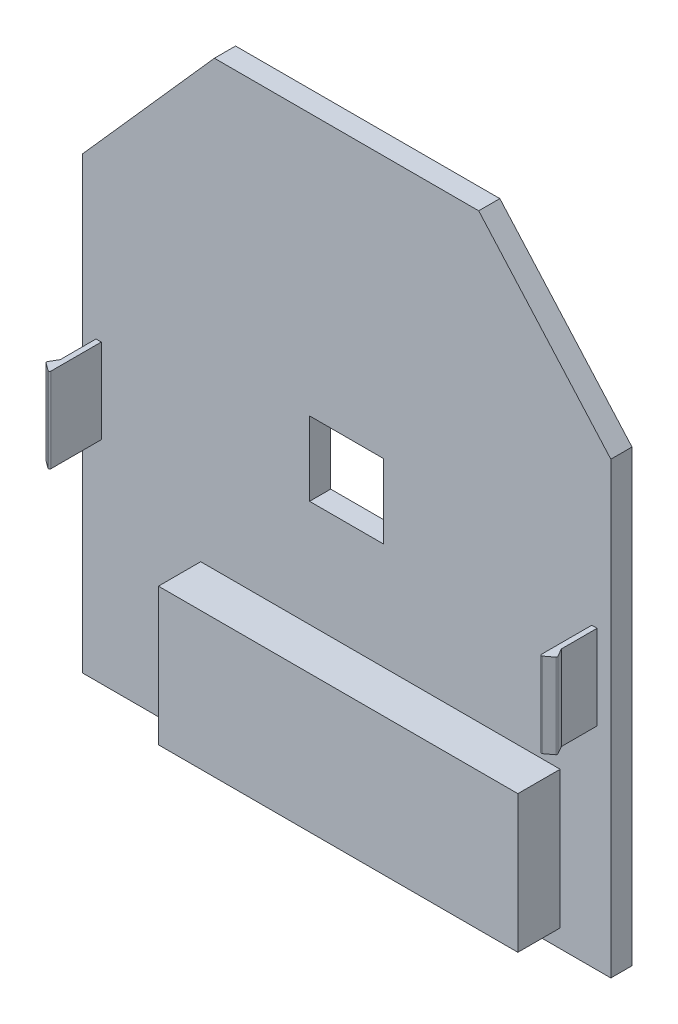
ISO-10303-21;
HEADER;
FILE_DESCRIPTION(('STEP AP214'),'2;1');
FILE_NAME('part.step','',(''),(''),'','','');
FILE_SCHEMA(('AUTOMOTIVE_DESIGN { 1 0 10303 214 1 1 1 1 }'));
ENDSEC;
DATA;
#1=APPLICATION_CONTEXT('core data for automotive mechanical design processes');
#2=APPLICATION_PROTOCOL_DEFINITION('international standard','automotive_design',2000,#1);
#3=PRODUCT_CONTEXT('',#1,'mechanical');
#4=PRODUCT('Part','Part','',(#3));
#5=PRODUCT_RELATED_PRODUCT_CATEGORY('part','',(#4));
#6=PRODUCT_DEFINITION_FORMATION('','',#4);
#7=PRODUCT_DEFINITION_CONTEXT('part definition',#1,'design');
#8=PRODUCT_DEFINITION('design','',#6,#7);
#9=PRODUCT_DEFINITION_SHAPE('','',#8);
#10=(LENGTH_UNIT() NAMED_UNIT(*) SI_UNIT(.MILLI.,.METRE.));
#11=(NAMED_UNIT(*) PLANE_ANGLE_UNIT() SI_UNIT($,.RADIAN.));
#12=(NAMED_UNIT(*) SI_UNIT($,.STERADIAN.) SOLID_ANGLE_UNIT());
#13=UNCERTAINTY_MEASURE_WITH_UNIT(LENGTH_MEASURE(1.E-05),#10,'distance_accuracy_value','');
#14=(GEOMETRIC_REPRESENTATION_CONTEXT(3) GLOBAL_UNCERTAINTY_ASSIGNED_CONTEXT((#13)) GLOBAL_UNIT_ASSIGNED_CONTEXT((#10,
#11,#12)) REPRESENTATION_CONTEXT('',''));
#15=CARTESIAN_POINT('',(0.,0.,0.));
#16=DIRECTION('',(0.,0.,1.));
#17=DIRECTION('',(1.,0.,0.));
#18=AXIS2_PLACEMENT_3D('',#15,#16,#17);
#19=CARTESIAN_POINT('',(0.,0.,4.));
#20=DIRECTION('',(0.,0.,-1.));
#21=DIRECTION('',(-1.,0.,0.));
#22=AXIS2_PLACEMENT_3D('',#19,#20,#21);
#23=PLANE('',#22);
#24=DIRECTION('',(1.,0.,0.));
#25=VECTOR('',#24,1.);
#26=CARTESIAN_POINT('',(2.6,40.,4.));
#27=LINE('',#26,#25);
#28=CARTESIAN_POINT('',(2.6,40.,4.));
#29=VERTEX_POINT('',#28);
#30=CARTESIAN_POINT('',(3.6,40.,4.));
#31=VERTEX_POINT('',#30);
#32=EDGE_CURVE('E268',#29,#31,#27,.T.);
#33=ORIENTED_EDGE('',*,*,#32,.F.);
#34=DIRECTION('',(0.,-1.,0.));
#35=VECTOR('',#34,1.);
#36=CARTESIAN_POINT('',(2.6,56.,4.));
#37=LINE('',#36,#35);
#38=CARTESIAN_POINT('',(2.6,56.,4.));
#39=VERTEX_POINT('',#38);
#40=EDGE_CURVE('E280',#39,#29,#37,.T.);
#41=ORIENTED_EDGE('',*,*,#40,.F.);
#42=DIRECTION('',(-1.,0.,0.));
#43=VECTOR('',#42,1.);
#44=CARTESIAN_POINT('',(3.6,56.,4.));
#45=LINE('',#44,#43);
#46=CARTESIAN_POINT('',(3.6,56.,4.));
#47=VERTEX_POINT('',#46);
#48=EDGE_CURVE('E276',#47,#39,#45,.T.);
#49=ORIENTED_EDGE('',*,*,#48,.F.);
#50=DIRECTION('',(0.,1.,0.));
#51=VECTOR('',#50,1.);
#52=CARTESIAN_POINT('',(3.6,40.,4.));
#53=LINE('',#52,#51);
#54=EDGE_CURVE('E272',#31,#47,#53,.T.);
#55=ORIENTED_EDGE('',*,*,#54,.F.);
#56=EDGE_LOOP('',(#33,#41,#49,#55));
#57=FACE_BOUND('',#56,.T.);
#58=DIRECTION('',(0.,1.,0.));
#59=VECTOR('',#58,1.);
#60=CARTESIAN_POINT('',(43.,0.,4.));
#61=LINE('',#60,#59);
#62=CARTESIAN_POINT('',(43.,49.60056997,4.));
#63=VERTEX_POINT('',#62);
#64=CARTESIAN_POINT('',(43.,63.60056997,4.));
#65=VERTEX_POINT('',#64);
#66=EDGE_CURVE('E332',#63,#65,#61,.T.);
#67=ORIENTED_EDGE('',*,*,#66,.T.);
#68=DIRECTION('',(1.,0.,0.));
#69=VECTOR('',#68,1.);
#70=CARTESIAN_POINT('',(0.,63.60056997,4.));
#71=LINE('',#70,#69);
#72=CARTESIAN_POINT('',(57.,63.60056997,4.));
#73=VERTEX_POINT('',#72);
#74=EDGE_CURVE('E336',#65,#73,#71,.T.);
#75=ORIENTED_EDGE('',*,*,#74,.T.);
#76=DIRECTION('',(0.,-1.,0.));
#77=VECTOR('',#76,1.);
#78=CARTESIAN_POINT('',(57.,0.,4.));
#79=LINE('',#78,#77);
#80=CARTESIAN_POINT('',(57.,49.60056997,4.));
#81=VERTEX_POINT('',#80);
#82=EDGE_CURVE('E315',#73,#81,#79,.T.);
#83=ORIENTED_EDGE('',*,*,#82,.T.);
#84=DIRECTION('',(-1.,0.,0.));
#85=VECTOR('',#84,1.);
#86=CARTESIAN_POINT('',(0.,49.60056997,4.));
#87=LINE('',#86,#85);
#88=EDGE_CURVE('E328',#81,#63,#87,.T.);
#89=ORIENTED_EDGE('',*,*,#88,.T.);
#90=EDGE_LOOP('',(#67,#75,#83,#89));
#91=FACE_BOUND('',#90,.T.);
#92=DIRECTION('',(1.,0.,0.));
#93=VECTOR('',#92,1.);
#94=CARTESIAN_POINT('',(100.,0.,4.));
#95=LINE('',#94,#93);
#96=CARTESIAN_POINT('',(0.,0.,4.));
#97=VERTEX_POINT('',#96);
#98=CARTESIAN_POINT('',(100.,0.,4.));
#99=VERTEX_POINT('',#98);
#100=EDGE_CURVE('E386',#97,#99,#95,.T.);
#101=ORIENTED_EDGE('',*,*,#100,.T.);
#102=DIRECTION('',(0.,1.,0.));
#103=VECTOR('',#102,1.);
#104=CARTESIAN_POINT('',(100.,85.,4.));
#105=LINE('',#104,#103);
#106=CARTESIAN_POINT('',(100.,85.,4.));
#107=VERTEX_POINT('',#106);
#108=EDGE_CURVE('E390',#99,#107,#105,.T.);
#109=ORIENTED_EDGE('',*,*,#108,.T.);
#110=DIRECTION('',(-0.663367550544201,0.74829372099797,0.));
#111=VECTOR('',#110,1.);
#112=CARTESIAN_POINT('',(75.,113.20056997,4.));
#113=LINE('',#112,#111);
#114=CARTESIAN_POINT('',(75.,113.20056997,4.));
#115=VERTEX_POINT('',#114);
#116=EDGE_CURVE('E394',#107,#115,#113,.T.);
#117=ORIENTED_EDGE('',*,*,#116,.T.);
#118=DIRECTION('',(-1.,0.,0.));
#119=VECTOR('',#118,1.);
#120=CARTESIAN_POINT('',(25.,113.20056997,4.));
#121=LINE('',#120,#119);
#122=CARTESIAN_POINT('',(25.,113.20056997,4.));
#123=VERTEX_POINT('',#122);
#124=EDGE_CURVE('E397',#115,#123,#121,.T.);
#125=ORIENTED_EDGE('',*,*,#124,.T.);
#126=DIRECTION('',(-0.6633675505442,-0.74829372099797,0.));
#127=VECTOR('',#126,1.);
#128=CARTESIAN_POINT('',(0.,85.,4.));
#129=LINE('',#128,#127);
#130=CARTESIAN_POINT('',(0.,85.,4.));
#131=VERTEX_POINT('',#130);
#132=EDGE_CURVE('E400',#123,#131,#129,.T.);
#133=ORIENTED_EDGE('',*,*,#132,.T.);
#134=DIRECTION('',(0.,-1.,0.));
#135=VECTOR('',#134,1.);
#136=CARTESIAN_POINT('',(0.,0.,4.));
#137=LINE('',#136,#135);
#138=EDGE_CURVE('E403',#131,#97,#137,.T.);
#139=ORIENTED_EDGE('',*,*,#138,.T.);
#140=EDGE_LOOP('',(#101,#109,#117,#125,#133,#139));
#141=FACE_BOUND('',#140,.T.);
#142=DIRECTION('',(0.,1.,0.));
#143=VECTOR('',#142,1.);
#144=CARTESIAN_POINT('',(90.41,29.41,4.));
#145=LINE('',#144,#143);
#146=CARTESIAN_POINT('',(90.41,3.41,4.));
#147=VERTEX_POINT('',#146);
#148=CARTESIAN_POINT('',(90.41,29.41,4.));
#149=VERTEX_POINT('',#148);
#150=EDGE_CURVE('E340',#147,#149,#145,.T.);
#151=ORIENTED_EDGE('',*,*,#150,.F.);
#152=DIRECTION('',(1.,0.,0.));
#153=VECTOR('',#152,1.);
#154=CARTESIAN_POINT('',(90.41,3.41,4.));
#155=LINE('',#154,#153);
#156=CARTESIAN_POINT('',(22.41,3.40999999999999,4.));
#157=VERTEX_POINT('',#156);
#158=EDGE_CURVE('E346',#157,#147,#155,.T.);
#159=ORIENTED_EDGE('',*,*,#158,.F.);
#160=DIRECTION('',(0.,-1.,0.));
#161=VECTOR('',#160,1.);
#162=CARTESIAN_POINT('',(22.41,3.40999999999999,4.));
#163=LINE('',#162,#161);
#164=CARTESIAN_POINT('',(22.41,29.41,4.));
#165=VERTEX_POINT('',#164);
#166=EDGE_CURVE('E363',#165,#157,#163,.T.);
#167=ORIENTED_EDGE('',*,*,#166,.F.);
#168=DIRECTION('',(-1.,0.,0.));
#169=VECTOR('',#168,1.);
#170=CARTESIAN_POINT('',(22.41,29.41,4.));
#171=LINE('',#170,#169);
#172=EDGE_CURVE('E359',#149,#165,#171,.T.);
#173=ORIENTED_EDGE('',*,*,#172,.F.);
#174=EDGE_LOOP('',(#151,#159,#167,#173));
#175=FACE_BOUND('',#174,.T.);
#176=DIRECTION('',(0.,-1.,0.));
#177=VECTOR('',#176,1.);
#178=CARTESIAN_POINT('',(96.4,40.,4.));
#179=LINE('',#178,#177);
#180=CARTESIAN_POINT('',(96.4,56.,4.));
#181=VERTEX_POINT('',#180);
#182=CARTESIAN_POINT('',(96.4,40.,4.));
#183=VERTEX_POINT('',#182);
#184=EDGE_CURVE('E229',#181,#183,#179,.T.);
#185=ORIENTED_EDGE('',*,*,#184,.F.);
#186=DIRECTION('',(-1.,0.,0.));
#187=VECTOR('',#186,1.);
#188=CARTESIAN_POINT('',(96.4,56.,4.));
#189=LINE('',#188,#187);
#190=CARTESIAN_POINT('',(97.4,56.,4.));
#191=VERTEX_POINT('',#190);
#192=EDGE_CURVE('E237',#191,#181,#189,.T.);
#193=ORIENTED_EDGE('',*,*,#192,.F.);
#194=DIRECTION('',(0.,1.,0.));
#195=VECTOR('',#194,1.);
#196=CARTESIAN_POINT('',(97.4,56.,4.));
#197=LINE('',#196,#195);
#198=CARTESIAN_POINT('',(97.4,40.,4.));
#199=VERTEX_POINT('',#198);
#200=EDGE_CURVE('E252',#199,#191,#197,.T.);
#201=ORIENTED_EDGE('',*,*,#200,.F.);
#202=DIRECTION('',(1.,0.,0.));
#203=VECTOR('',#202,1.);
#204=CARTESIAN_POINT('',(97.4,40.,4.));
#205=LINE('',#204,#203);
#206=EDGE_CURVE('E245',#183,#199,#205,.T.);
#207=ORIENTED_EDGE('',*,*,#206,.F.);
#208=EDGE_LOOP('',(#185,#193,#201,#207));
#209=FACE_BOUND('',#208,.T.);
#210=ADVANCED_FACE('F40',(#57,#91,#141,#175,#209),#23,.F.);
#211=CARTESIAN_POINT('',(100.,0.,4.));
#212=DIRECTION('',(0.,1.,0.));
#213=DIRECTION('',(0.,0.,1.));
#214=AXIS2_PLACEMENT_3D('',#211,#212,#213);
#215=PLANE('',#214);
#216=DIRECTION('',(1.,0.,0.));
#217=VECTOR('',#216,1.);
#218=CARTESIAN_POINT('',(100.,0.,0.));
#219=LINE('',#218,#217);
#220=CARTESIAN_POINT('',(0.,0.,0.));
#221=VERTEX_POINT('',#220);
#222=CARTESIAN_POINT('',(100.,0.,0.));
#223=VERTEX_POINT('',#222);
#224=EDGE_CURVE('E385',#221,#223,#219,.T.);
#225=ORIENTED_EDGE('',*,*,#224,.T.);
#226=DIRECTION('',(0.,0.,-1.));
#227=VECTOR('',#226,1.);
#228=CARTESIAN_POINT('',(100.,0.,4.));
#229=LINE('',#228,#227);
#230=EDGE_CURVE('E442',#99,#223,#229,.T.);
#231=ORIENTED_EDGE('',*,*,#230,.F.);
#232=ORIENTED_EDGE('',*,*,#100,.F.);
#233=DIRECTION('',(0.,0.,-1.));
#234=VECTOR('',#233,1.);
#235=CARTESIAN_POINT('',(0.,0.,4.));
#236=LINE('',#235,#234);
#237=EDGE_CURVE('E406',#97,#221,#236,.T.);
#238=ORIENTED_EDGE('',*,*,#237,.T.);
#239=EDGE_LOOP('',(#225,#231,#232,#238));
#240=FACE_BOUND('',#239,.T.);
#241=ADVANCED_FACE('F535',(#240),#215,.F.);
#242=CARTESIAN_POINT('',(100.,85.,4.));
#243=DIRECTION('',(-1.,0.,0.));
#244=DIRECTION('',(0.,-1.,0.));
#245=AXIS2_PLACEMENT_3D('',#242,#243,#244);
#246=PLANE('',#245);
#247=DIRECTION('',(0.,1.,0.));
#248=VECTOR('',#247,1.);
#249=CARTESIAN_POINT('',(100.,85.,0.));
#250=LINE('',#249,#248);
#251=CARTESIAN_POINT('',(100.,85.,0.));
#252=VERTEX_POINT('',#251);
#253=EDGE_CURVE('E410',#223,#252,#250,.T.);
#254=ORIENTED_EDGE('',*,*,#253,.T.);
#255=DIRECTION('',(0.,0.,-1.));
#256=VECTOR('',#255,1.);
#257=CARTESIAN_POINT('',(100.,85.,4.));
#258=LINE('',#257,#256);
#259=EDGE_CURVE('E438',#107,#252,#258,.T.);
#260=ORIENTED_EDGE('',*,*,#259,.F.);
#261=ORIENTED_EDGE('',*,*,#108,.F.);
#262=ORIENTED_EDGE('',*,*,#230,.T.);
#263=EDGE_LOOP('',(#254,#260,#261,#262));
#264=FACE_BOUND('',#263,.T.);
#265=ADVANCED_FACE('F541',(#264),#246,.F.);
#266=CARTESIAN_POINT('',(75.,113.20056997,4.));
#267=DIRECTION('',(-0.74829372099797,-0.663367550544201,0.));
#268=DIRECTION('',(0.663367550544201,-0.74829372099797,0.));
#269=AXIS2_PLACEMENT_3D('',#266,#267,#268);
#270=PLANE('',#269);
#271=DIRECTION('',(-0.663367550544201,0.74829372099797,0.));
#272=VECTOR('',#271,1.);
#273=CARTESIAN_POINT('',(75.,113.20056997,0.));
#274=LINE('',#273,#272);
#275=CARTESIAN_POINT('',(75.,113.20056997,0.));
#276=VERTEX_POINT('',#275);
#277=EDGE_CURVE('E413',#252,#276,#274,.T.);
#278=ORIENTED_EDGE('',*,*,#277,.T.);
#279=DIRECTION('',(0.,0.,-1.));
#280=VECTOR('',#279,1.);
#281=CARTESIAN_POINT('',(75.,113.20056997,4.));
#282=LINE('',#281,#280);
#283=EDGE_CURVE('E434',#115,#276,#282,.T.);
#284=ORIENTED_EDGE('',*,*,#283,.F.);
#285=ORIENTED_EDGE('',*,*,#116,.F.);
#286=ORIENTED_EDGE('',*,*,#259,.T.);
#287=EDGE_LOOP('',(#278,#284,#285,#286));
#288=FACE_BOUND('',#287,.T.);
#289=ADVANCED_FACE('F565',(#288),#270,.F.);
#290=CARTESIAN_POINT('',(25.,113.20056997,4.));
#291=DIRECTION('',(0.,-1.,0.));
#292=DIRECTION('',(1.,0.,0.));
#293=AXIS2_PLACEMENT_3D('',#290,#291,#292);
#294=PLANE('',#293);
#295=DIRECTION('',(-1.,0.,0.));
#296=VECTOR('',#295,1.);
#297=CARTESIAN_POINT('',(25.,113.20056997,0.));
#298=LINE('',#297,#296);
#299=CARTESIAN_POINT('',(25.,113.20056997,0.));
#300=VERTEX_POINT('',#299);
#301=EDGE_CURVE('E415',#276,#300,#298,.T.);
#302=ORIENTED_EDGE('',*,*,#301,.T.);
#303=DIRECTION('',(0.,0.,-1.));
#304=VECTOR('',#303,1.);
#305=CARTESIAN_POINT('',(25.,113.20056997,4.));
#306=LINE('',#305,#304);
#307=EDGE_CURVE('E430',#123,#300,#306,.T.);
#308=ORIENTED_EDGE('',*,*,#307,.F.);
#309=ORIENTED_EDGE('',*,*,#124,.F.);
#310=ORIENTED_EDGE('',*,*,#283,.T.);
#311=EDGE_LOOP('',(#302,#308,#309,#310));
#312=FACE_BOUND('',#311,.T.);
#313=ADVANCED_FACE('F561',(#312),#294,.F.);
#314=CARTESIAN_POINT('',(0.,85.,4.));
#315=DIRECTION('',(0.74829372099797,-0.6633675505442,0.));
#316=DIRECTION('',(0.6633675505442,0.74829372099797,0.));
#317=AXIS2_PLACEMENT_3D('',#314,#315,#316);
#318=PLANE('',#317);
#319=DIRECTION('',(-0.6633675505442,-0.74829372099797,0.));
#320=VECTOR('',#319,1.);
#321=CARTESIAN_POINT('',(0.,85.,0.));
#322=LINE('',#321,#320);
#323=CARTESIAN_POINT('',(0.,85.,0.));
#324=VERTEX_POINT('',#323);
#325=EDGE_CURVE('E418',#300,#324,#322,.T.);
#326=ORIENTED_EDGE('',*,*,#325,.T.);
#327=DIRECTION('',(0.,0.,-1.));
#328=VECTOR('',#327,1.);
#329=CARTESIAN_POINT('',(0.,85.,4.));
#330=LINE('',#329,#328);
#331=EDGE_CURVE('E426',#131,#324,#330,.T.);
#332=ORIENTED_EDGE('',*,*,#331,.F.);
#333=ORIENTED_EDGE('',*,*,#132,.F.);
#334=ORIENTED_EDGE('',*,*,#307,.T.);
#335=EDGE_LOOP('',(#326,#332,#333,#334));
#336=FACE_BOUND('',#335,.T.);
#337=ADVANCED_FACE('F557',(#336),#318,.F.);
#338=CARTESIAN_POINT('',(0.,0.,4.));
#339=DIRECTION('',(1.,0.,0.));
#340=DIRECTION('',(0.,0.,-1.));
#341=AXIS2_PLACEMENT_3D('',#338,#339,#340);
#342=PLANE('',#341);
#343=DIRECTION('',(0.,-1.,0.));
#344=VECTOR('',#343,1.);
#345=CARTESIAN_POINT('',(0.,0.,0.));
#346=LINE('',#345,#344);
#347=EDGE_CURVE('E391',#324,#221,#346,.T.);
#348=ORIENTED_EDGE('',*,*,#347,.T.);
#349=ORIENTED_EDGE('',*,*,#237,.F.);
#350=ORIENTED_EDGE('',*,*,#138,.F.);
#351=ORIENTED_EDGE('',*,*,#331,.T.);
#352=EDGE_LOOP('',(#348,#349,#350,#351));
#353=FACE_BOUND('',#352,.T.);
#354=ADVANCED_FACE('F553',(#353),#342,.F.);
#355=CARTESIAN_POINT('',(0.,0.,0.));
#356=DIRECTION('',(0.,0.,-1.));
#357=DIRECTION('',(-1.,0.,0.));
#358=AXIS2_PLACEMENT_3D('',#355,#356,#357);
#359=PLANE('',#358);
#360=DIRECTION('',(1.,0.,0.));
#361=VECTOR('',#360,1.);
#362=CARTESIAN_POINT('',(57.,63.60056997,0.));
#363=LINE('',#362,#361);
#364=CARTESIAN_POINT('',(43.,63.60056997,0.));
#365=VERTEX_POINT('',#364);
#366=CARTESIAN_POINT('',(57.,63.60056997,0.));
#367=VERTEX_POINT('',#366);
#368=EDGE_CURVE('E296',#365,#367,#363,.T.);
#369=ORIENTED_EDGE('',*,*,#368,.F.);
#370=DIRECTION('',(0.,1.,0.));
#371=VECTOR('',#370,1.);
#372=CARTESIAN_POINT('',(43.,63.60056997,0.));
#373=LINE('',#372,#371);
#374=CARTESIAN_POINT('',(43.,49.60056997,0.));
#375=VERTEX_POINT('',#374);
#376=EDGE_CURVE('E307',#375,#365,#373,.T.);
#377=ORIENTED_EDGE('',*,*,#376,.F.);
#378=DIRECTION('',(-1.,0.,0.));
#379=VECTOR('',#378,1.);
#380=CARTESIAN_POINT('',(43.,49.60056997,0.));
#381=LINE('',#380,#379);
#382=CARTESIAN_POINT('',(57.,49.60056997,0.));
#383=VERTEX_POINT('',#382);
#384=EDGE_CURVE('E303',#383,#375,#381,.T.);
#385=ORIENTED_EDGE('',*,*,#384,.F.);
#386=DIRECTION('',(0.,-1.,0.));
#387=VECTOR('',#386,1.);
#388=CARTESIAN_POINT('',(57.,49.60056997,0.));
#389=LINE('',#388,#387);
#390=EDGE_CURVE('E299',#367,#383,#389,.T.);
#391=ORIENTED_EDGE('',*,*,#390,.F.);
#392=EDGE_LOOP('',(#369,#377,#385,#391));
#393=FACE_BOUND('',#392,.T.);
#394=ORIENTED_EDGE('',*,*,#224,.F.);
#395=ORIENTED_EDGE('',*,*,#347,.F.);
#396=ORIENTED_EDGE('',*,*,#325,.F.);
#397=ORIENTED_EDGE('',*,*,#301,.F.);
#398=ORIENTED_EDGE('',*,*,#277,.F.);
#399=ORIENTED_EDGE('',*,*,#253,.F.);
#400=EDGE_LOOP('',(#394,#395,#396,#397,#398,#399));
#401=FACE_BOUND('',#400,.T.);
#402=ADVANCED_FACE('F550',(#393,#401),#359,.T.);
#403=CARTESIAN_POINT('',(90.41,29.41,12.));
#404=DIRECTION('',(-1.,0.,0.));
#405=DIRECTION('',(0.,0.,1.));
#406=AXIS2_PLACEMENT_3D('',#403,#404,#405);
#407=PLANE('',#406);
#408=ORIENTED_EDGE('',*,*,#150,.T.);
#409=DIRECTION('',(0.,0.,-1.));
#410=VECTOR('',#409,1.);
#411=CARTESIAN_POINT('',(90.41,29.41,12.));
#412=LINE('',#411,#410);
#413=CARTESIAN_POINT('',(90.41,29.41,12.));
#414=VERTEX_POINT('',#413);
#415=EDGE_CURVE('E381',#414,#149,#412,.T.);
#416=ORIENTED_EDGE('',*,*,#415,.F.);
#417=DIRECTION('',(0.,1.,0.));
#418=VECTOR('',#417,1.);
#419=CARTESIAN_POINT('',(90.41,29.41,12.));
#420=LINE('',#419,#418);
#421=CARTESIAN_POINT('',(90.41,3.41,12.));
#422=VERTEX_POINT('',#421);
#423=EDGE_CURVE('E341',#422,#414,#420,.T.);
#424=ORIENTED_EDGE('',*,*,#423,.F.);
#425=DIRECTION('',(0.,0.,-1.));
#426=VECTOR('',#425,1.);
#427=CARTESIAN_POINT('',(90.41,3.41,12.));
#428=LINE('',#427,#426);
#429=EDGE_CURVE('E355',#422,#147,#428,.T.);
#430=ORIENTED_EDGE('',*,*,#429,.T.);
#431=EDGE_LOOP('',(#408,#416,#424,#430));
#432=FACE_BOUND('',#431,.T.);
#433=ADVANCED_FACE('F548',(#432),#407,.F.);
#434=CARTESIAN_POINT('',(22.41,29.41,12.));
#435=DIRECTION('',(0.,-1.,0.));
#436=DIRECTION('',(0.,0.,-1.));
#437=AXIS2_PLACEMENT_3D('',#434,#435,#436);
#438=PLANE('',#437);
#439=ORIENTED_EDGE('',*,*,#172,.T.);
#440=DIRECTION('',(0.,0.,-1.));
#441=VECTOR('',#440,1.);
#442=CARTESIAN_POINT('',(22.41,29.41,12.));
#443=LINE('',#442,#441);
#444=CARTESIAN_POINT('',(22.41,29.41,12.));
#445=VERTEX_POINT('',#444);
#446=EDGE_CURVE('E377',#445,#165,#443,.T.);
#447=ORIENTED_EDGE('',*,*,#446,.F.);
#448=DIRECTION('',(-1.,0.,0.));
#449=VECTOR('',#448,1.);
#450=CARTESIAN_POINT('',(22.41,29.41,12.));
#451=LINE('',#450,#449);
#452=EDGE_CURVE('E345',#414,#445,#451,.T.);
#453=ORIENTED_EDGE('',*,*,#452,.F.);
#454=ORIENTED_EDGE('',*,*,#415,.T.);
#455=EDGE_LOOP('',(#439,#447,#453,#454));
#456=FACE_BOUND('',#455,.T.);
#457=ADVANCED_FACE('F799',(#456),#438,.F.);
#458=CARTESIAN_POINT('',(22.41,3.40999999999999,12.));
#459=DIRECTION('',(1.,0.,0.));
#460=DIRECTION('',(0.,0.,-1.));
#461=AXIS2_PLACEMENT_3D('',#458,#459,#460);
#462=PLANE('',#461);
#463=ORIENTED_EDGE('',*,*,#166,.T.);
#464=DIRECTION('',(0.,0.,-1.));
#465=VECTOR('',#464,1.);
#466=CARTESIAN_POINT('',(22.41,3.40999999999999,12.));
#467=LINE('',#466,#465);
#468=CARTESIAN_POINT('',(22.41,3.40999999999999,12.));
#469=VERTEX_POINT('',#468);
#470=EDGE_CURVE('E373',#469,#157,#467,.T.);
#471=ORIENTED_EDGE('',*,*,#470,.F.);
#472=DIRECTION('',(0.,-1.,0.));
#473=VECTOR('',#472,1.);
#474=CARTESIAN_POINT('',(22.41,3.40999999999999,12.));
#475=LINE('',#474,#473);
#476=EDGE_CURVE('E349',#445,#469,#475,.T.);
#477=ORIENTED_EDGE('',*,*,#476,.F.);
#478=ORIENTED_EDGE('',*,*,#446,.T.);
#479=EDGE_LOOP('',(#463,#471,#477,#478));
#480=FACE_BOUND('',#479,.T.);
#481=ADVANCED_FACE('F796',(#480),#462,.F.);
#482=CARTESIAN_POINT('',(90.41,3.41,12.));
#483=DIRECTION('',(0.,1.,0.));
#484=DIRECTION('',(-1.,0.,0.));
#485=AXIS2_PLACEMENT_3D('',#482,#483,#484);
#486=PLANE('',#485);
#487=ORIENTED_EDGE('',*,*,#158,.T.);
#488=ORIENTED_EDGE('',*,*,#429,.F.);
#489=DIRECTION('',(1.,0.,0.));
#490=VECTOR('',#489,1.);
#491=CARTESIAN_POINT('',(90.41,3.41,12.));
#492=LINE('',#491,#490);
#493=EDGE_CURVE('E352',#469,#422,#492,.T.);
#494=ORIENTED_EDGE('',*,*,#493,.F.);
#495=ORIENTED_EDGE('',*,*,#470,.T.);
#496=EDGE_LOOP('',(#487,#488,#494,#495));
#497=FACE_BOUND('',#496,.T.);
#498=ADVANCED_FACE('F792',(#497),#486,.F.);
#499=CARTESIAN_POINT('',(0.,0.,12.));
#500=DIRECTION('',(0.,0.,-1.));
#501=DIRECTION('',(-1.,0.,0.));
#502=AXIS2_PLACEMENT_3D('',#499,#500,#501);
#503=PLANE('',#502);
#504=ORIENTED_EDGE('',*,*,#423,.T.);
#505=ORIENTED_EDGE('',*,*,#452,.T.);
#506=ORIENTED_EDGE('',*,*,#476,.T.);
#507=ORIENTED_EDGE('',*,*,#493,.T.);
#508=EDGE_LOOP('',(#504,#505,#506,#507));
#509=FACE_BOUND('',#508,.T.);
#510=ADVANCED_FACE('F788',(#509),#503,.F.);
#511=CARTESIAN_POINT('',(57.,63.60056997,12.));
#512=DIRECTION('',(0.,1.,0.));
#513=DIRECTION('',(-1.,0.,0.));
#514=AXIS2_PLACEMENT_3D('',#511,#512,#513);
#515=PLANE('',#514);
#516=DIRECTION('',(0.,0.,-1.));
#517=VECTOR('',#516,1.);
#518=CARTESIAN_POINT('',(43.,63.60056997,12.));
#519=LINE('',#518,#517);
#520=EDGE_CURVE('E312',#65,#365,#519,.T.);
#521=ORIENTED_EDGE('',*,*,#520,.T.);
#522=ORIENTED_EDGE('',*,*,#368,.T.);
#523=DIRECTION('',(0.,0.,-1.));
#524=VECTOR('',#523,1.);
#525=CARTESIAN_POINT('',(57.,63.60056997,12.));
#526=LINE('',#525,#524);
#527=EDGE_CURVE('E311',#73,#367,#526,.T.);
#528=ORIENTED_EDGE('',*,*,#527,.F.);
#529=ORIENTED_EDGE('',*,*,#74,.F.);
#530=EDGE_LOOP('',(#521,#522,#528,#529));
#531=FACE_BOUND('',#530,.T.);
#532=ADVANCED_FACE('F778',(#531),#515,.F.);
#533=CARTESIAN_POINT('',(43.,63.60056997,12.));
#534=DIRECTION('',(-1.,0.,0.));
#535=DIRECTION('',(0.,0.,1.));
#536=AXIS2_PLACEMENT_3D('',#533,#534,#535);
#537=PLANE('',#536);
#538=DIRECTION('',(0.,0.,-1.));
#539=VECTOR('',#538,1.);
#540=CARTESIAN_POINT('',(43.,49.60056997,12.));
#541=LINE('',#540,#539);
#542=EDGE_CURVE('E316',#63,#375,#541,.T.);
#543=ORIENTED_EDGE('',*,*,#542,.T.);
#544=ORIENTED_EDGE('',*,*,#376,.T.);
#545=ORIENTED_EDGE('',*,*,#520,.F.);
#546=ORIENTED_EDGE('',*,*,#66,.F.);
#547=EDGE_LOOP('',(#543,#544,#545,#546));
#548=FACE_BOUND('',#547,.T.);
#549=ADVANCED_FACE('F774',(#548),#537,.F.);
#550=CARTESIAN_POINT('',(43.,49.60056997,12.));
#551=DIRECTION('',(0.,-1.,0.));
#552=DIRECTION('',(0.,0.,-1.));
#553=AXIS2_PLACEMENT_3D('',#550,#551,#552);
#554=PLANE('',#553);
#555=DIRECTION('',(0.,0.,-1.));
#556=VECTOR('',#555,1.);
#557=CARTESIAN_POINT('',(57.,49.60056997,12.));
#558=LINE('',#557,#556);
#559=EDGE_CURVE('E319',#81,#383,#558,.T.);
#560=ORIENTED_EDGE('',*,*,#559,.T.);
#561=ORIENTED_EDGE('',*,*,#384,.T.);
#562=ORIENTED_EDGE('',*,*,#542,.F.);
#563=ORIENTED_EDGE('',*,*,#88,.F.);
#564=EDGE_LOOP('',(#560,#561,#562,#563));
#565=FACE_BOUND('',#564,.T.);
#566=ADVANCED_FACE('F777',(#565),#554,.F.);
#567=CARTESIAN_POINT('',(57.,49.60056997,12.));
#568=DIRECTION('',(1.,0.,0.));
#569=DIRECTION('',(0.,0.,-1.));
#570=AXIS2_PLACEMENT_3D('',#567,#568,#569);
#571=PLANE('',#570);
#572=ORIENTED_EDGE('',*,*,#527,.T.);
#573=ORIENTED_EDGE('',*,*,#390,.T.);
#574=ORIENTED_EDGE('',*,*,#559,.F.);
#575=ORIENTED_EDGE('',*,*,#82,.F.);
#576=EDGE_LOOP('',(#572,#573,#574,#575));
#577=FACE_BOUND('',#576,.T.);
#578=ADVANCED_FACE('F712',(#577),#571,.F.);
#579=CARTESIAN_POINT('',(2.6,40.,12.5));
#580=DIRECTION('',(0.,1.,0.));
#581=DIRECTION('',(0.,0.,1.));
#582=AXIS2_PLACEMENT_3D('',#579,#580,#581);
#583=PLANE('',#582);
#584=DIRECTION('',(0.,0.,-1.));
#585=VECTOR('',#584,1.);
#586=CARTESIAN_POINT('',(3.6,40.,12.5));
#587=LINE('',#586,#585);
#588=CARTESIAN_POINT('',(3.6,40.,13.5));
#589=VERTEX_POINT('',#588);
#590=EDGE_CURVE('E293',#589,#31,#587,.T.);
#591=ORIENTED_EDGE('',*,*,#590,.F.);
#592=CARTESIAN_POINT('',(3.35,40.,13.5));
#593=DIRECTION('',(0.,1.,0.));
#594=DIRECTION('',(0.,0.,1.));
#595=AXIS2_PLACEMENT_3D('',#592,#593,#594);
#596=CIRCLE('',#595,0.25);
#597=CARTESIAN_POINT('',(3.2,40.,13.7));
#598=VERTEX_POINT('',#597);
#599=EDGE_CURVE('E63',#589,#598,#596,.F.);
#600=ORIENTED_EDGE('',*,*,#599,.T.);
#601=DIRECTION('',(-0.8,0.,-0.6));
#602=VECTOR('',#601,1.);
#603=CARTESIAN_POINT('',(1.6,40.,12.5));
#604=LINE('',#603,#602);
#605=CARTESIAN_POINT('',(1.77735026918963,40.,12.6330127018922));
#606=VERTEX_POINT('',#605);
#607=EDGE_CURVE('E617',#598,#606,#604,.T.);
#608=ORIENTED_EDGE('',*,*,#607,.T.);
#609=CARTESIAN_POINT('',(1.92735026918963,40.,12.4330127018922));
#610=DIRECTION('',(0.,1.,0.));
#611=DIRECTION('',(0.,0.,1.));
#612=AXIS2_PLACEMENT_3D('',#609,#610,#611);
#613=CIRCLE('',#612,0.25);
#614=CARTESIAN_POINT('',(1.71084391824352,40.,12.3080127018922));
#615=VERTEX_POINT('',#614);
#616=EDGE_CURVE('E464',#606,#615,#613,.F.);
#617=ORIENTED_EDGE('',*,*,#616,.T.);
#618=DIRECTION('',(0.5,0.,-0.866025403784439));
#619=VECTOR('',#618,1.);
#620=CARTESIAN_POINT('',(1.6,40.,12.5));
#621=LINE('',#620,#619);
#622=CARTESIAN_POINT('',(2.6,40.,10.7679491924311));
#623=VERTEX_POINT('',#622);
#624=EDGE_CURVE('E600',#615,#623,#621,.T.);
#625=ORIENTED_EDGE('',*,*,#624,.T.);
#626=DIRECTION('',(0.,0.,-1.));
#627=VECTOR('',#626,1.);
#628=CARTESIAN_POINT('',(2.6,40.,12.5));
#629=LINE('',#628,#627);
#630=EDGE_CURVE('E284',#623,#29,#629,.T.);
#631=ORIENTED_EDGE('',*,*,#630,.T.);
#632=ORIENTED_EDGE('',*,*,#32,.T.);
#633=EDGE_LOOP('',(#591,#600,#608,#617,#625,#631,#632));
#634=FACE_BOUND('',#633,.T.);
#635=ADVANCED_FACE('F597',(#634),#583,.F.);
#636=CARTESIAN_POINT('',(3.6,40.,12.5));
#637=DIRECTION('',(-1.,0.,0.));
#638=DIRECTION('',(0.,0.,1.));
#639=AXIS2_PLACEMENT_3D('',#636,#637,#638);
#640=PLANE('',#639);
#641=DIRECTION('',(0.,0.,-1.));
#642=VECTOR('',#641,1.);
#643=CARTESIAN_POINT('',(3.6,56.,12.5));
#644=LINE('',#643,#642);
#645=CARTESIAN_POINT('',(3.6,56.,13.5));
#646=VERTEX_POINT('',#645);
#647=EDGE_CURVE('E290',#646,#47,#644,.T.);
#648=ORIENTED_EDGE('',*,*,#647,.F.);
#649=DIRECTION('',(0.,-1.,0.));
#650=VECTOR('',#649,1.);
#651=CARTESIAN_POINT('',(3.6,40.,13.5));
#652=LINE('',#651,#650);
#653=EDGE_CURVE('E484',#646,#589,#652,.T.);
#654=ORIENTED_EDGE('',*,*,#653,.T.);
#655=ORIENTED_EDGE('',*,*,#590,.T.);
#656=ORIENTED_EDGE('',*,*,#54,.T.);
#657=EDGE_LOOP('',(#648,#654,#655,#656));
#658=FACE_BOUND('',#657,.T.);
#659=ADVANCED_FACE('F594',(#658),#640,.F.);
#660=CARTESIAN_POINT('',(3.6,56.,12.5));
#661=DIRECTION('',(0.,-1.,0.));
#662=DIRECTION('',(0.,0.,-1.));
#663=AXIS2_PLACEMENT_3D('',#660,#661,#662);
#664=PLANE('',#663);
#665=DIRECTION('',(0.8,0.,0.6));
#666=VECTOR('',#665,1.);
#667=CARTESIAN_POINT('',(1.6,56.,12.5));
#668=LINE('',#667,#666);
#669=CARTESIAN_POINT('',(1.77735026918963,56.,12.6330127018922));
#670=VERTEX_POINT('',#669);
#671=CARTESIAN_POINT('',(3.2,56.,13.7));
#672=VERTEX_POINT('',#671);
#673=EDGE_CURVE('E592',#670,#672,#668,.T.);
#674=ORIENTED_EDGE('',*,*,#673,.T.);
#675=CARTESIAN_POINT('',(3.35,56.,13.5));
#676=DIRECTION('',(0.,-1.,0.));
#677=DIRECTION('',(0.,0.,-1.));
#678=AXIS2_PLACEMENT_3D('',#675,#676,#677);
#679=CIRCLE('',#678,0.25);
#680=EDGE_CURVE('E11',#672,#646,#679,.F.);
#681=ORIENTED_EDGE('',*,*,#680,.T.);
#682=ORIENTED_EDGE('',*,*,#647,.T.);
#683=ORIENTED_EDGE('',*,*,#48,.T.);
#684=DIRECTION('',(0.,0.,-1.));
#685=VECTOR('',#684,1.);
#686=CARTESIAN_POINT('',(2.6,56.,12.5));
#687=LINE('',#686,#685);
#688=CARTESIAN_POINT('',(2.6,56.,10.7679491924311));
#689=VERTEX_POINT('',#688);
#690=EDGE_CURVE('E287',#689,#39,#687,.T.);
#691=ORIENTED_EDGE('',*,*,#690,.F.);
#692=DIRECTION('',(-0.5,0.,0.866025403784439));
#693=VECTOR('',#692,1.);
#694=CARTESIAN_POINT('',(1.6,56.,12.5));
#695=LINE('',#694,#693);
#696=CARTESIAN_POINT('',(1.71084391824352,56.,12.3080127018922));
#697=VERTEX_POINT('',#696);
#698=EDGE_CURVE('E611',#689,#697,#695,.T.);
#699=ORIENTED_EDGE('',*,*,#698,.T.);
#700=CARTESIAN_POINT('',(1.92735026918963,56.,12.4330127018922));
#701=DIRECTION('',(0.,-1.,0.));
#702=DIRECTION('',(0.,0.,-1.));
#703=AXIS2_PLACEMENT_3D('',#700,#701,#702);
#704=CIRCLE('',#703,0.25);
#705=EDGE_CURVE('E469',#697,#670,#704,.F.);
#706=ORIENTED_EDGE('',*,*,#705,.T.);
#707=EDGE_LOOP('',(#674,#681,#682,#683,#691,#699,#706));
#708=FACE_BOUND('',#707,.T.);
#709=ADVANCED_FACE('F590',(#708),#664,.F.);
#710=CARTESIAN_POINT('',(2.6,56.,12.5));
#711=DIRECTION('',(1.,0.,0.));
#712=DIRECTION('',(0.,1.,0.));
#713=AXIS2_PLACEMENT_3D('',#710,#711,#712);
#714=PLANE('',#713);
#715=ORIENTED_EDGE('',*,*,#630,.F.);
#716=DIRECTION('',(0.,-1.,0.));
#717=VECTOR('',#716,1.);
#718=CARTESIAN_POINT('',(2.6,59.8008094430932,10.7679491924311));
#719=LINE('',#718,#717);
#720=EDGE_CURVE('E604',#689,#623,#719,.T.);
#721=ORIENTED_EDGE('',*,*,#720,.F.);
#722=ORIENTED_EDGE('',*,*,#690,.T.);
#723=ORIENTED_EDGE('',*,*,#40,.T.);
#724=EDGE_LOOP('',(#715,#721,#722,#723));
#725=FACE_BOUND('',#724,.T.);
#726=ADVANCED_FACE('F603',(#725),#714,.F.);
#727=CARTESIAN_POINT('',(96.4,40.,12.5));
#728=DIRECTION('',(1.,0.,0.));
#729=DIRECTION('',(0.,0.,-1.));
#730=AXIS2_PLACEMENT_3D('',#727,#728,#729);
#731=PLANE('',#730);
#732=DIRECTION('',(0.,0.,-1.));
#733=VECTOR('',#732,1.);
#734=CARTESIAN_POINT('',(96.4,40.,12.5));
#735=LINE('',#734,#733);
#736=CARTESIAN_POINT('',(96.4,40.,13.5));
#737=VERTEX_POINT('',#736);
#738=EDGE_CURVE('E265',#737,#183,#735,.T.);
#739=ORIENTED_EDGE('',*,*,#738,.F.);
#740=DIRECTION('',(0.,-1.,0.));
#741=VECTOR('',#740,1.);
#742=CARTESIAN_POINT('',(96.4,56.,13.5));
#743=LINE('',#742,#741);
#744=CARTESIAN_POINT('',(96.4,56.,13.5));
#745=VERTEX_POINT('',#744);
#746=EDGE_CURVE('E231',#737,#745,#743,.F.);
#747=ORIENTED_EDGE('',*,*,#746,.T.);
#748=DIRECTION('',(0.,0.,-1.));
#749=VECTOR('',#748,1.);
#750=CARTESIAN_POINT('',(96.4,56.,12.5));
#751=LINE('',#750,#749);
#752=EDGE_CURVE('E225',#745,#181,#751,.T.);
#753=ORIENTED_EDGE('',*,*,#752,.T.);
#754=ORIENTED_EDGE('',*,*,#184,.T.);
#755=EDGE_LOOP('',(#739,#747,#753,#754));
#756=FACE_BOUND('',#755,.T.);
#757=ADVANCED_FACE('F228',(#756),#731,.F.);
#758=CARTESIAN_POINT('',(97.4,40.,12.5));
#759=DIRECTION('',(0.,1.,0.));
#760=DIRECTION('',(0.,0.,1.));
#761=AXIS2_PLACEMENT_3D('',#758,#759,#760);
#762=PLANE('',#761);
#763=DIRECTION('',(-0.799999999999998,0.,0.600000000000002));
#764=VECTOR('',#763,1.);
#765=CARTESIAN_POINT('',(98.4,40.,12.5));
#766=LINE('',#765,#764);
#767=CARTESIAN_POINT('',(98.2226497308104,40.,12.6330127018922));
#768=VERTEX_POINT('',#767);
#769=CARTESIAN_POINT('',(96.8,40.,13.7));
#770=VERTEX_POINT('',#769);
#771=EDGE_CURVE('E493',#768,#770,#766,.T.);
#772=ORIENTED_EDGE('',*,*,#771,.T.);
#773=CARTESIAN_POINT('',(96.65,40.,13.5));
#774=DIRECTION('',(0.,1.,0.));
#775=DIRECTION('',(0.,0.,1.));
#776=AXIS2_PLACEMENT_3D('',#773,#774,#775);
#777=CIRCLE('',#776,0.25);
#778=EDGE_CURVE('E476',#770,#737,#777,.F.);
#779=ORIENTED_EDGE('',*,*,#778,.T.);
#780=ORIENTED_EDGE('',*,*,#738,.T.);
#781=ORIENTED_EDGE('',*,*,#206,.T.);
#782=DIRECTION('',(0.,0.,-1.));
#783=VECTOR('',#782,1.);
#784=CARTESIAN_POINT('',(97.4,40.,12.5));
#785=LINE('',#784,#783);
#786=CARTESIAN_POINT('',(97.4,40.,10.7679491924311));
#787=VERTEX_POINT('',#786);
#788=EDGE_CURVE('E262',#787,#199,#785,.T.);
#789=ORIENTED_EDGE('',*,*,#788,.F.);
#790=DIRECTION('',(0.5,0.,0.866025403784438));
#791=VECTOR('',#790,1.);
#792=CARTESIAN_POINT('',(98.4,40.,12.5));
#793=LINE('',#792,#791);
#794=CARTESIAN_POINT('',(98.2891560817565,40.,12.3080127018922));
#795=VERTEX_POINT('',#794);
#796=EDGE_CURVE('E523',#787,#795,#793,.T.);
#797=ORIENTED_EDGE('',*,*,#796,.T.);
#798=CARTESIAN_POINT('',(98.0726497308104,40.,12.4330127018922));
#799=DIRECTION('',(0.,1.,0.));
#800=DIRECTION('',(0.,0.,1.));
#801=AXIS2_PLACEMENT_3D('',#798,#799,#800);
#802=CIRCLE('',#801,0.25);
#803=EDGE_CURVE('E450',#795,#768,#802,.F.);
#804=ORIENTED_EDGE('',*,*,#803,.T.);
#805=EDGE_LOOP('',(#772,#779,#780,#781,#789,#797,#804));
#806=FACE_BOUND('',#805,.T.);
#807=ADVANCED_FACE('F505',(#806),#762,.F.);
#808=CARTESIAN_POINT('',(97.4,56.,12.5));
#809=DIRECTION('',(-1.,0.,0.));
#810=DIRECTION('',(0.,-1.,0.));
#811=AXIS2_PLACEMENT_3D('',#808,#809,#810);
#812=PLANE('',#811);
#813=DIRECTION('',(0.,0.,-1.));
#814=VECTOR('',#813,1.);
#815=CARTESIAN_POINT('',(97.4,56.,12.5));
#816=LINE('',#815,#814);
#817=CARTESIAN_POINT('',(97.4,56.,10.7679491924311));
#818=VERTEX_POINT('',#817);
#819=EDGE_CURVE('E236',#818,#191,#816,.T.);
#820=ORIENTED_EDGE('',*,*,#819,.F.);
#821=DIRECTION('',(0.,-1.,0.));
#822=VECTOR('',#821,1.);
#823=CARTESIAN_POINT('',(97.4,59.8008094430932,10.7679491924311));
#824=LINE('',#823,#822);
#825=EDGE_CURVE('E491',#818,#787,#824,.T.);
#826=ORIENTED_EDGE('',*,*,#825,.T.);
#827=ORIENTED_EDGE('',*,*,#788,.T.);
#828=ORIENTED_EDGE('',*,*,#200,.T.);
#829=EDGE_LOOP('',(#820,#826,#827,#828));
#830=FACE_BOUND('',#829,.T.);
#831=ADVANCED_FACE('F525',(#830),#812,.F.);
#832=CARTESIAN_POINT('',(96.4,56.,12.5));
#833=DIRECTION('',(0.,-1.,0.));
#834=DIRECTION('',(0.,0.,-1.));
#835=AXIS2_PLACEMENT_3D('',#832,#833,#834);
#836=PLANE('',#835);
#837=ORIENTED_EDGE('',*,*,#752,.F.);
#838=CARTESIAN_POINT('',(96.65,56.,13.5));
#839=DIRECTION('',(0.,-1.,0.));
#840=DIRECTION('',(0.,0.,-1.));
#841=AXIS2_PLACEMENT_3D('',#838,#839,#840);
#842=CIRCLE('',#841,0.25);
#843=CARTESIAN_POINT('',(96.8,56.,13.7));
#844=VERTEX_POINT('',#843);
#845=EDGE_CURVE('E481',#745,#844,#842,.F.);
#846=ORIENTED_EDGE('',*,*,#845,.T.);
#847=DIRECTION('',(0.799999999999998,0.,-0.600000000000002));
#848=VECTOR('',#847,1.);
#849=CARTESIAN_POINT('',(98.4,56.,12.5));
#850=LINE('',#849,#848);
#851=CARTESIAN_POINT('',(98.2226497308104,56.,12.6330127018922));
#852=VERTEX_POINT('',#851);
#853=EDGE_CURVE('E492',#844,#852,#850,.T.);
#854=ORIENTED_EDGE('',*,*,#853,.T.);
#855=CARTESIAN_POINT('',(98.0726497308104,56.,12.4330127018922));
#856=DIRECTION('',(0.,-1.,0.));
#857=DIRECTION('',(0.,0.,-1.));
#858=AXIS2_PLACEMENT_3D('',#855,#856,#857);
#859=CIRCLE('',#858,0.25);
#860=CARTESIAN_POINT('',(98.2891560817565,56.,12.3080127018922));
#861=VERTEX_POINT('',#860);
#862=EDGE_CURVE('E457',#852,#861,#859,.F.);
#863=ORIENTED_EDGE('',*,*,#862,.T.);
#864=DIRECTION('',(-0.5,0.,-0.866025403784439));
#865=VECTOR('',#864,1.);
#866=CARTESIAN_POINT('',(98.4,56.,12.5));
#867=LINE('',#866,#865);
#868=EDGE_CURVE('E247',#861,#818,#867,.T.);
#869=ORIENTED_EDGE('',*,*,#868,.T.);
#870=ORIENTED_EDGE('',*,*,#819,.T.);
#871=ORIENTED_EDGE('',*,*,#192,.T.);
#872=EDGE_LOOP('',(#837,#846,#854,#863,#869,#870,#871));
#873=FACE_BOUND('',#872,.T.);
#874=ADVANCED_FACE('F249',(#873),#836,.F.);
#875=CARTESIAN_POINT('',(98.4,59.8008094430932,12.5));
#876=DIRECTION('',(0.600000000000002,0.,0.799999999999998));
#877=DIRECTION('',(0.799999999999998,0.,-0.600000000000002));
#878=AXIS2_PLACEMENT_3D('',#875,#876,#877);
#879=PLANE('',#878);
#880=ORIENTED_EDGE('',*,*,#853,.F.);
#881=DIRECTION('',(0.,-1.,0.));
#882=VECTOR('',#881,1.);
#883=CARTESIAN_POINT('',(96.8,40.,13.7));
#884=LINE('',#883,#882);
#885=EDGE_CURVE('E472',#844,#770,#884,.T.);
#886=ORIENTED_EDGE('',*,*,#885,.T.);
#887=ORIENTED_EDGE('',*,*,#771,.F.);
#888=DIRECTION('',(0.,-1.,0.));
#889=VECTOR('',#888,1.);
#890=CARTESIAN_POINT('',(98.2226497308104,59.8008094430932,12.6330127018922));
#891=LINE('',#890,#889);
#892=EDGE_CURVE('E453',#768,#852,#891,.F.);
#893=ORIENTED_EDGE('',*,*,#892,.T.);
#894=EDGE_LOOP('',(#880,#886,#887,#893));
#895=FACE_BOUND('',#894,.T.);
#896=ADVANCED_FACE('F513',(#895),#879,.T.);
#897=CARTESIAN_POINT('',(98.4,59.8008094430932,12.5));
#898=DIRECTION('',(0.866025403784438,0.,-0.5));
#899=DIRECTION('',(-0.5,0.,-0.866025403784439));
#900=AXIS2_PLACEMENT_3D('',#897,#898,#899);
#901=PLANE('',#900);
#902=ORIENTED_EDGE('',*,*,#868,.F.);
#903=DIRECTION('',(0.,-1.,0.));
#904=VECTOR('',#903,1.);
#905=CARTESIAN_POINT('',(98.2891560817565,59.8008094430932,12.3080127018922));
#906=LINE('',#905,#904);
#907=EDGE_CURVE('E446',#861,#795,#906,.T.);
#908=ORIENTED_EDGE('',*,*,#907,.T.);
#909=ORIENTED_EDGE('',*,*,#796,.F.);
#910=ORIENTED_EDGE('',*,*,#825,.F.);
#911=EDGE_LOOP('',(#902,#908,#909,#910));
#912=FACE_BOUND('',#911,.T.);
#913=ADVANCED_FACE('F522',(#912),#901,.T.);
#914=CARTESIAN_POINT('',(1.6,59.8008094430932,12.5));
#915=DIRECTION('',(-0.866025403784439,0.,-0.5));
#916=DIRECTION('',(-0.5,0.,0.866025403784439));
#917=AXIS2_PLACEMENT_3D('',#914,#915,#916);
#918=PLANE('',#917);
#919=ORIENTED_EDGE('',*,*,#624,.F.);
#920=DIRECTION('',(0.,-1.,0.));
#921=VECTOR('',#920,1.);
#922=CARTESIAN_POINT('',(1.71084391824352,59.8008094430932,12.3080127018922));
#923=LINE('',#922,#921);
#924=EDGE_CURVE('E467',#615,#697,#923,.F.);
#925=ORIENTED_EDGE('',*,*,#924,.T.);
#926=ORIENTED_EDGE('',*,*,#698,.F.);
#927=ORIENTED_EDGE('',*,*,#720,.T.);
#928=EDGE_LOOP('',(#919,#925,#926,#927));
#929=FACE_BOUND('',#928,.T.);
#930=ADVANCED_FACE('F608',(#929),#918,.T.);
#931=CARTESIAN_POINT('',(1.6,59.8008094430932,12.5));
#932=DIRECTION('',(-0.6,0.,0.8));
#933=DIRECTION('',(0.8,0.,0.6));
#934=AXIS2_PLACEMENT_3D('',#931,#932,#933);
#935=PLANE('',#934);
#936=ORIENTED_EDGE('',*,*,#607,.F.);
#937=DIRECTION('',(0.,-1.,0.));
#938=VECTOR('',#937,1.);
#939=CARTESIAN_POINT('',(3.2,56.,13.7));
#940=LINE('',#939,#938);
#941=EDGE_CURVE('E49',#598,#672,#940,.F.);
#942=ORIENTED_EDGE('',*,*,#941,.T.);
#943=ORIENTED_EDGE('',*,*,#673,.F.);
#944=DIRECTION('',(0.,-1.,0.));
#945=VECTOR('',#944,1.);
#946=CARTESIAN_POINT('',(1.77735026918963,59.8008094430932,12.6330127018922));
#947=LINE('',#946,#945);
#948=EDGE_CURVE('E460',#670,#606,#947,.T.);
#949=ORIENTED_EDGE('',*,*,#948,.T.);
#950=EDGE_LOOP('',(#936,#942,#943,#949));
#951=FACE_BOUND('',#950,.T.);
#952=ADVANCED_FACE('F576',(#951),#935,.T.);
#953=CARTESIAN_POINT('',(98.0726497308104,59.8008094430932,12.4330127018922));
#954=DIRECTION('',(0.,-1.,0.));
#955=DIRECTION('',(0.,0.,-1.));
#956=AXIS2_PLACEMENT_3D('',#953,#954,#955);
#957=CYLINDRICAL_SURFACE('',#956,0.25);
#958=ORIENTED_EDGE('',*,*,#862,.F.);
#959=ORIENTED_EDGE('',*,*,#892,.F.);
#960=ORIENTED_EDGE('',*,*,#803,.F.);
#961=ORIENTED_EDGE('',*,*,#907,.F.);
#962=EDGE_LOOP('',(#958,#959,#960,#961));
#963=FACE_BOUND('',#962,.T.);
#964=ADVANCED_FACE('F519',(#963),#957,.T.);
#965=CARTESIAN_POINT('',(1.92735026918963,59.8008094430932,12.4330127018922));
#966=DIRECTION('',(0.,-1.,0.));
#967=DIRECTION('',(0.,0.,-1.));
#968=AXIS2_PLACEMENT_3D('',#965,#966,#967);
#969=CYLINDRICAL_SURFACE('',#968,0.25);
#970=ORIENTED_EDGE('',*,*,#705,.F.);
#971=ORIENTED_EDGE('',*,*,#924,.F.);
#972=ORIENTED_EDGE('',*,*,#616,.F.);
#973=ORIENTED_EDGE('',*,*,#948,.F.);
#974=EDGE_LOOP('',(#970,#971,#972,#973));
#975=FACE_BOUND('',#974,.T.);
#976=ADVANCED_FACE('F575',(#975),#969,.T.);
#977=CARTESIAN_POINT('',(96.65,59.8008094430932,13.5));
#978=DIRECTION('',(0.,1.,0.));
#979=DIRECTION('',(0.,0.,1.));
#980=AXIS2_PLACEMENT_3D('',#977,#978,#979);
#981=CYLINDRICAL_SURFACE('',#980,0.25);
#982=ORIENTED_EDGE('',*,*,#845,.F.);
#983=ORIENTED_EDGE('',*,*,#746,.F.);
#984=ORIENTED_EDGE('',*,*,#778,.F.);
#985=ORIENTED_EDGE('',*,*,#885,.F.);
#986=EDGE_LOOP('',(#982,#983,#984,#985));
#987=FACE_BOUND('',#986,.T.);
#988=ADVANCED_FACE('F509',(#987),#981,.T.);
#989=CARTESIAN_POINT('',(3.35,40.,13.5));
#990=DIRECTION('',(0.,1.,0.));
#991=DIRECTION('',(0.,0.,1.));
#992=AXIS2_PLACEMENT_3D('',#989,#990,#991);
#993=CYLINDRICAL_SURFACE('',#992,0.25);
#994=ORIENTED_EDGE('',*,*,#680,.F.);
#995=ORIENTED_EDGE('',*,*,#941,.F.);
#996=ORIENTED_EDGE('',*,*,#599,.F.);
#997=ORIENTED_EDGE('',*,*,#653,.F.);
#998=EDGE_LOOP('',(#994,#995,#996,#997));
#999=FACE_BOUND('',#998,.T.);
#1000=ADVANCED_FACE('F42',(#999),#993,.T.);
#1001=CLOSED_SHELL('',(#210,#241,#265,#289,#313,#337,#354,#402,#433,#457,#481,#498,#510,#532,
#549,#566,#578,#635,#659,#709,#726,#757,#807,#831,#874,#896,#913,#930,#952,#964,#976,#988,#1000));
#1002=MANIFOLD_SOLID_BREP('B2',#1001);
#1003=ADVANCED_BREP_SHAPE_REPRESENTATION('',(#18,#1002),#14);
#1004=SHAPE_DEFINITION_REPRESENTATION(#9,#1003);
ENDSEC;
END-ISO-10303-21;
